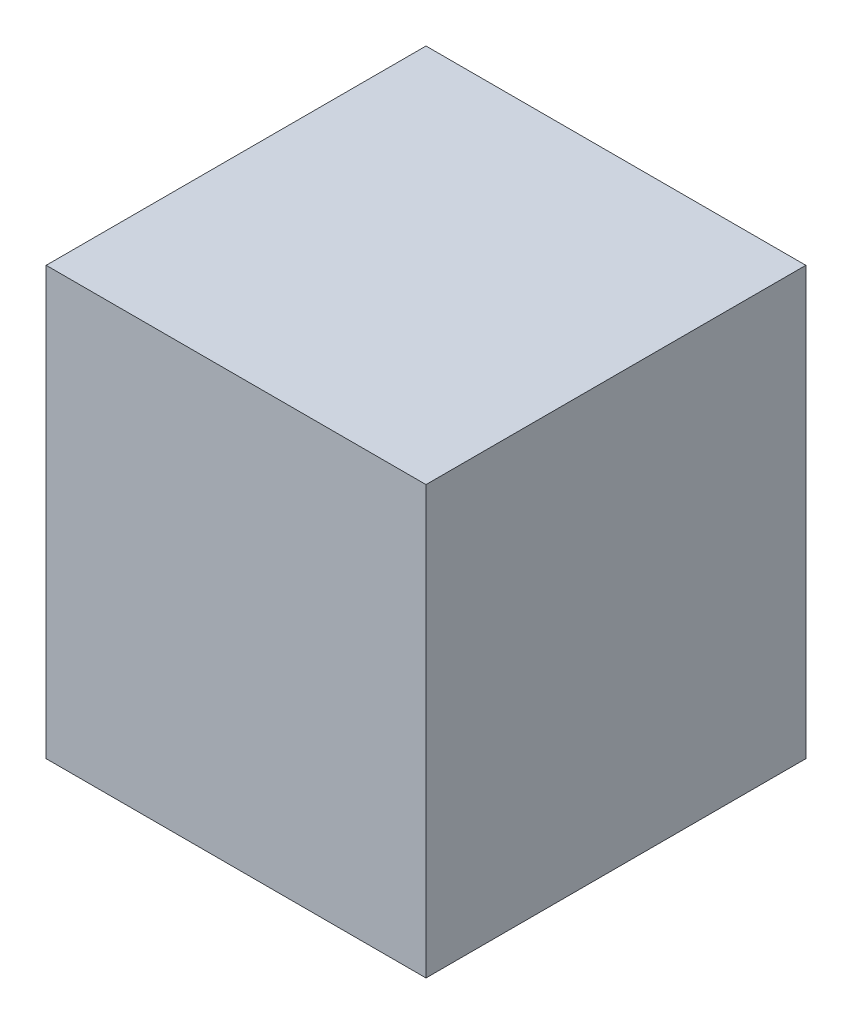
ISO-10303-21;
HEADER;
FILE_DESCRIPTION(('STEP AP214'),'2;1');
FILE_NAME('part.step','',(''),(''),'','','');
FILE_SCHEMA(('AUTOMOTIVE_DESIGN { 1 0 10303 214 1 1 1 1 }'));
ENDSEC;
DATA;
#1=APPLICATION_CONTEXT('core data for automotive mechanical design processes');
#2=APPLICATION_PROTOCOL_DEFINITION('international standard','automotive_design',2000,#1);
#3=PRODUCT_CONTEXT('',#1,'mechanical');
#4=PRODUCT('Part','Part','',(#3));
#5=PRODUCT_RELATED_PRODUCT_CATEGORY('part','',(#4));
#6=PRODUCT_DEFINITION_FORMATION('','',#4);
#7=PRODUCT_DEFINITION_CONTEXT('part definition',#1,'design');
#8=PRODUCT_DEFINITION('design','',#6,#7);
#9=PRODUCT_DEFINITION_SHAPE('','',#8);
#10=(LENGTH_UNIT() NAMED_UNIT(*) SI_UNIT(.MILLI.,.METRE.));
#11=(NAMED_UNIT(*) PLANE_ANGLE_UNIT() SI_UNIT($,.RADIAN.));
#12=(NAMED_UNIT(*) SI_UNIT($,.STERADIAN.) SOLID_ANGLE_UNIT());
#13=UNCERTAINTY_MEASURE_WITH_UNIT(LENGTH_MEASURE(1.E-05),#10,'distance_accuracy_value','');
#14=(GEOMETRIC_REPRESENTATION_CONTEXT(3) GLOBAL_UNCERTAINTY_ASSIGNED_CONTEXT((#13)) GLOBAL_UNIT_ASSIGNED_CONTEXT((#10,
#11,#12)) REPRESENTATION_CONTEXT('',''));
#15=CARTESIAN_POINT('',(0.,0.,0.));
#16=DIRECTION('',(0.,0.,1.));
#17=DIRECTION('',(1.,0.,0.));
#18=AXIS2_PLACEMENT_3D('',#15,#16,#17);
#19=CARTESIAN_POINT('',(-50.8,114.3,-50.8));
#20=DIRECTION('',(1.,0.,0.));
#21=DIRECTION('',(0.,0.,-1.));
#22=AXIS2_PLACEMENT_3D('',#19,#20,#21);
#23=PLANE('',#22);
#24=DIRECTION('',(0.,0.,1.));
#25=VECTOR('',#24,1.);
#26=CARTESIAN_POINT('',(-50.8,0.,-50.8));
#27=LINE('',#26,#25);
#28=CARTESIAN_POINT('',(-50.8,0.,-50.8));
#29=VERTEX_POINT('',#28);
#30=CARTESIAN_POINT('',(-50.8,0.,50.8));
#31=VERTEX_POINT('',#30);
#32=EDGE_CURVE('E95',#29,#31,#27,.T.);
#33=ORIENTED_EDGE('',*,*,#32,.T.);
#34=DIRECTION('',(0.,-1.,0.));
#35=VECTOR('',#34,1.);
#36=CARTESIAN_POINT('',(-50.8,114.3,50.8));
#37=LINE('',#36,#35);
#38=CARTESIAN_POINT('',(-50.8,114.3,50.8));
#39=VERTEX_POINT('',#38);
#40=EDGE_CURVE('E11',#39,#31,#37,.T.);
#41=ORIENTED_EDGE('',*,*,#40,.F.);
#42=DIRECTION('',(0.,0.,1.));
#43=VECTOR('',#42,1.);
#44=CARTESIAN_POINT('',(-50.8,114.3,-50.8));
#45=LINE('',#44,#43);
#46=CARTESIAN_POINT('',(-50.8,114.3,-50.8));
#47=VERTEX_POINT('',#46);
#48=EDGE_CURVE('E83',#47,#39,#45,.T.);
#49=ORIENTED_EDGE('',*,*,#48,.F.);
#50=DIRECTION('',(0.,-1.,0.));
#51=VECTOR('',#50,1.);
#52=CARTESIAN_POINT('',(-50.8,114.3,-50.8));
#53=LINE('',#52,#51);
#54=EDGE_CURVE('E91',#47,#29,#53,.T.);
#55=ORIENTED_EDGE('',*,*,#54,.T.);
#56=EDGE_LOOP('',(#33,#41,#49,#55));
#57=FACE_BOUND('',#56,.T.);
#58=ADVANCED_FACE('F32',(#57),#23,.F.);
#59=CARTESIAN_POINT('',(-50.8,114.3,50.8));
#60=DIRECTION('',(0.,0.,-1.));
#61=DIRECTION('',(-1.,0.,0.));
#62=AXIS2_PLACEMENT_3D('',#59,#60,#61);
#63=PLANE('',#62);
#64=DIRECTION('',(1.,0.,0.));
#65=VECTOR('',#64,1.);
#66=CARTESIAN_POINT('',(-50.8,0.,50.8));
#67=LINE('',#66,#65);
#68=CARTESIAN_POINT('',(50.8,0.,50.8));
#69=VERTEX_POINT('',#68);
#70=EDGE_CURVE('E87',#31,#69,#67,.T.);
#71=ORIENTED_EDGE('',*,*,#70,.T.);
#72=DIRECTION('',(0.,-1.,0.));
#73=VECTOR('',#72,1.);
#74=CARTESIAN_POINT('',(50.8,114.3,50.8));
#75=LINE('',#74,#73);
#76=CARTESIAN_POINT('',(50.8,114.3,50.8));
#77=VERTEX_POINT('',#76);
#78=EDGE_CURVE('E40',#77,#69,#75,.T.);
#79=ORIENTED_EDGE('',*,*,#78,.F.);
#80=DIRECTION('',(1.,0.,0.));
#81=VECTOR('',#80,1.);
#82=CARTESIAN_POINT('',(-50.8,114.3,50.8));
#83=LINE('',#82,#81);
#84=EDGE_CURVE('E78',#39,#77,#83,.T.);
#85=ORIENTED_EDGE('',*,*,#84,.F.);
#86=ORIENTED_EDGE('',*,*,#40,.T.);
#87=EDGE_LOOP('',(#71,#79,#85,#86));
#88=FACE_BOUND('',#87,.T.);
#89=ADVANCED_FACE('F86',(#88),#63,.F.);
#90=CARTESIAN_POINT('',(50.8,114.3,-50.8));
#91=DIRECTION('',(-1.,0.,0.));
#92=DIRECTION('',(0.,0.,1.));
#93=AXIS2_PLACEMENT_3D('',#90,#91,#92);
#94=PLANE('',#93);
#95=DIRECTION('',(0.,0.,-1.));
#96=VECTOR('',#95,1.);
#97=CARTESIAN_POINT('',(50.8,0.,-50.8));
#98=LINE('',#97,#96);
#99=CARTESIAN_POINT('',(50.8,0.,-50.8));
#100=VERTEX_POINT('',#99);
#101=EDGE_CURVE('E65',#69,#100,#98,.T.);
#102=ORIENTED_EDGE('',*,*,#101,.T.);
#103=DIRECTION('',(0.,-1.,0.));
#104=VECTOR('',#103,1.);
#105=CARTESIAN_POINT('',(50.8,114.3,-50.8));
#106=LINE('',#105,#104);
#107=CARTESIAN_POINT('',(50.8,114.3,-50.8));
#108=VERTEX_POINT('',#107);
#109=EDGE_CURVE('E88',#108,#100,#106,.T.);
#110=ORIENTED_EDGE('',*,*,#109,.F.);
#111=DIRECTION('',(0.,0.,-1.));
#112=VECTOR('',#111,1.);
#113=CARTESIAN_POINT('',(50.8,114.3,-50.8));
#114=LINE('',#113,#112);
#115=EDGE_CURVE('E81',#77,#108,#114,.T.);
#116=ORIENTED_EDGE('',*,*,#115,.F.);
#117=ORIENTED_EDGE('',*,*,#78,.T.);
#118=EDGE_LOOP('',(#102,#110,#116,#117));
#119=FACE_BOUND('',#118,.T.);
#120=ADVANCED_FACE('F89',(#119),#94,.F.);
#121=CARTESIAN_POINT('',(-50.8,114.3,-50.8));
#122=DIRECTION('',(0.,0.,1.));
#123=DIRECTION('',(1.,0.,0.));
#124=AXIS2_PLACEMENT_3D('',#121,#122,#123);
#125=PLANE('',#124);
#126=DIRECTION('',(-1.,0.,0.));
#127=VECTOR('',#126,1.);
#128=CARTESIAN_POINT('',(-50.8,0.,-50.8));
#129=LINE('',#128,#127);
#130=EDGE_CURVE('E71',#100,#29,#129,.T.);
#131=ORIENTED_EDGE('',*,*,#130,.T.);
#132=ORIENTED_EDGE('',*,*,#54,.F.);
#133=DIRECTION('',(-1.,0.,0.));
#134=VECTOR('',#133,1.);
#135=CARTESIAN_POINT('',(-50.8,114.3,-50.8));
#136=LINE('',#135,#134);
#137=EDGE_CURVE('E48',#108,#47,#136,.T.);
#138=ORIENTED_EDGE('',*,*,#137,.F.);
#139=ORIENTED_EDGE('',*,*,#109,.T.);
#140=EDGE_LOOP('',(#131,#132,#138,#139));
#141=FACE_BOUND('',#140,.T.);
#142=ADVANCED_FACE('F102',(#141),#125,.F.);
#143=CARTESIAN_POINT('',(0.,114.3,0.));
#144=DIRECTION('',(0.,1.,0.));
#145=DIRECTION('',(0.,0.,1.));
#146=AXIS2_PLACEMENT_3D('',#143,#144,#145);
#147=PLANE('',#146);
#148=ORIENTED_EDGE('',*,*,#48,.T.);
#149=ORIENTED_EDGE('',*,*,#84,.T.);
#150=ORIENTED_EDGE('',*,*,#115,.T.);
#151=ORIENTED_EDGE('',*,*,#137,.T.);
#152=EDGE_LOOP('',(#148,#149,#150,#151));
#153=FACE_BOUND('',#152,.T.);
#154=ADVANCED_FACE('F79',(#153),#147,.T.);
#155=CARTESIAN_POINT('',(0.,0.,0.));
#156=DIRECTION('',(0.,1.,0.));
#157=DIRECTION('',(0.,0.,1.));
#158=AXIS2_PLACEMENT_3D('',#155,#156,#157);
#159=PLANE('',#158);
#160=ORIENTED_EDGE('',*,*,#32,.F.);
#161=ORIENTED_EDGE('',*,*,#130,.F.);
#162=ORIENTED_EDGE('',*,*,#101,.F.);
#163=ORIENTED_EDGE('',*,*,#70,.F.);
#164=EDGE_LOOP('',(#160,#161,#162,#163));
#165=FACE_BOUND('',#164,.T.);
#166=ADVANCED_FACE('F105',(#165),#159,.F.);
#167=CLOSED_SHELL('',(#58,#89,#120,#142,#154,#166));
#168=MANIFOLD_SOLID_BREP('B2',#167);
#169=ADVANCED_BREP_SHAPE_REPRESENTATION('',(#18,#168),#14);
#170=SHAPE_DEFINITION_REPRESENTATION(#9,#169);
ENDSEC;
END-ISO-10303-21;
